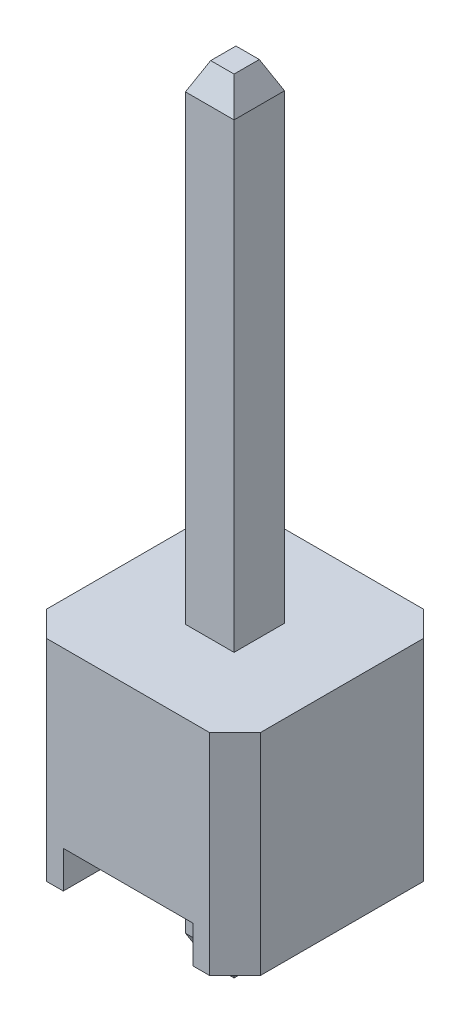
ISO-10303-21;
HEADER;
FILE_DESCRIPTION(('STEP AP214'),'2;1');
FILE_NAME('part.step','',(''),(''),'','','');
FILE_SCHEMA(('AUTOMOTIVE_DESIGN { 1 0 10303 214 1 1 1 1 }'));
ENDSEC;
DATA;
#1=APPLICATION_CONTEXT('core data for automotive mechanical design processes');
#2=APPLICATION_PROTOCOL_DEFINITION('international standard','automotive_design',2000,#1);
#3=PRODUCT_CONTEXT('',#1,'mechanical');
#4=PRODUCT('Part','Part','',(#3));
#5=PRODUCT_RELATED_PRODUCT_CATEGORY('part','',(#4));
#6=PRODUCT_DEFINITION_FORMATION('','',#4);
#7=PRODUCT_DEFINITION_CONTEXT('part definition',#1,'design');
#8=PRODUCT_DEFINITION('design','',#6,#7);
#9=PRODUCT_DEFINITION_SHAPE('','',#8);
#10=(LENGTH_UNIT() NAMED_UNIT(*) SI_UNIT(.MILLI.,.METRE.));
#11=(NAMED_UNIT(*) PLANE_ANGLE_UNIT() SI_UNIT($,.RADIAN.));
#12=(NAMED_UNIT(*) SI_UNIT($,.STERADIAN.) SOLID_ANGLE_UNIT());
#13=UNCERTAINTY_MEASURE_WITH_UNIT(LENGTH_MEASURE(1.E-05),#10,'distance_accuracy_value','');
#14=(GEOMETRIC_REPRESENTATION_CONTEXT(3) GLOBAL_UNCERTAINTY_ASSIGNED_CONTEXT((#13)) GLOBAL_UNIT_ASSIGNED_CONTEXT((#10,
#11,#12)) REPRESENTATION_CONTEXT('',''));
#15=CARTESIAN_POINT('',(0.,0.,0.));
#16=DIRECTION('',(0.,0.,1.));
#17=DIRECTION('',(1.,0.,0.));
#18=AXIS2_PLACEMENT_3D('',#15,#16,#17);
#19=CARTESIAN_POINT('',(-19.1812561045914,-5.69124998633488,-4.12837288882801));
#20=DIRECTION('',(0.,-1.,0.));
#21=DIRECTION('',(0.,0.,-1.));
#22=AXIS2_PLACEMENT_3D('',#19,#20,#21);
#23=PLANE('',#22);
#24=DIRECTION('',(0.,0.,1.));
#25=VECTOR('',#24,1.);
#26=CARTESIAN_POINT('',(-19.0312561045914,-5.69124998633488,-3.52837288882801));
#27=LINE('',#26,#25);
#28=CARTESIAN_POINT('',(-19.0312561045914,-5.69124998633488,-3.67837288882801));
#29=VERTEX_POINT('',#28);
#30=CARTESIAN_POINT('',(-19.0312561045914,-5.69124998633488,-3.97837288882801));
#31=VERTEX_POINT('',#30);
#32=EDGE_CURVE('E194',#29,#31,#27,.F.);
#33=ORIENTED_EDGE('',*,*,#32,.T.);
#34=DIRECTION('',(1.,0.,0.));
#35=VECTOR('',#34,1.);
#36=CARTESIAN_POINT('',(-19.1812561045914,-5.69124998633488,-3.97837288882801));
#37=LINE('',#36,#35);
#38=CARTESIAN_POINT('',(-18.7537499744834,-5.69124998633488,-3.97837288882801));
#39=VERTEX_POINT('',#38);
#40=EDGE_CURVE('E179',#31,#39,#37,.T.);
#41=ORIENTED_EDGE('',*,*,#40,.T.);
#42=DIRECTION('',(0.,0.,1.));
#43=VECTOR('',#42,1.);
#44=CARTESIAN_POINT('',(-18.7537499744834,-5.69124998633488,-4.12837288882801));
#45=LINE('',#44,#43);
#46=CARTESIAN_POINT('',(-18.7537499744834,-5.69124998633488,-3.67837288882801));
#47=VERTEX_POINT('',#46);
#48=EDGE_CURVE('E20',#39,#47,#45,.T.);
#49=ORIENTED_EDGE('',*,*,#48,.T.);
#50=DIRECTION('',(1.,0.,0.));
#51=VECTOR('',#50,1.);
#52=CARTESIAN_POINT('',(-18.6037499744834,-5.69124998633488,-3.67837288882801));
#53=LINE('',#52,#51);
#54=EDGE_CURVE('E174',#47,#29,#53,.F.);
#55=ORIENTED_EDGE('',*,*,#54,.T.);
#56=EDGE_LOOP('',(#33,#41,#49,#55));
#57=FACE_BOUND('',#56,.T.);
#58=ADVANCED_FACE('F17',(#57),#23,.T.);
#59=CARTESIAN_POINT('',(-18.6037499744834,-5.36957394825845,-4.12837288882801));
#60=DIRECTION('',(-0.90630778703665,0.4226182617407,0.));
#61=DIRECTION('',(-0.4226182617407,-0.90630778703665,0.));
#62=AXIS2_PLACEMENT_3D('',#59,#60,#61);
#63=PLANE('',#62);
#64=DIRECTION('',(0.,0.,-1.));
#65=VECTOR('',#64,1.);
#66=CARTESIAN_POINT('',(-18.6037499744834,-5.36957394825845,-4.12837288882801));
#67=LINE('',#66,#65);
#68=CARTESIAN_POINT('',(-18.6037499744834,-5.36957394825845,-3.52837288882801));
#69=VERTEX_POINT('',#68);
#70=CARTESIAN_POINT('',(-18.6037499744834,-5.36957394825845,-4.12837288882801));
#71=VERTEX_POINT('',#70);
#72=EDGE_CURVE('E186',#69,#71,#67,.T.);
#73=ORIENTED_EDGE('',*,*,#72,.F.);
#74=DIRECTION('',(-0.389281620635035,-0.834817129478983,-0.389281620635024));
#75=VECTOR('',#74,1.);
#76=CARTESIAN_POINT('',(-18.6037499744834,-5.36957394825845,-3.52837288882801));
#77=LINE('',#76,#75);
#78=EDGE_CURVE('E182',#69,#47,#77,.T.);
#79=ORIENTED_EDGE('',*,*,#78,.T.);
#80=ORIENTED_EDGE('',*,*,#48,.F.);
#81=DIRECTION('',(0.389281620635034,0.834817129478983,-0.389281620635025));
#82=VECTOR('',#81,1.);
#83=CARTESIAN_POINT('',(-18.7537499744834,-5.69124998633488,-3.97837288882801));
#84=LINE('',#83,#82);
#85=EDGE_CURVE('E202',#39,#71,#84,.T.);
#86=ORIENTED_EDGE('',*,*,#85,.T.);
#87=EDGE_LOOP('',(#73,#79,#80,#86));
#88=FACE_BOUND('',#87,.T.);
#89=ADVANCED_FACE('F184',(#88),#63,.F.);
#90=CARTESIAN_POINT('',(-18.6037499744834,-5.36957394825845,-3.52837288882801));
#91=DIRECTION('',(0.,0.422618261740701,-0.906307787036649));
#92=DIRECTION('',(0.,0.906307787036649,0.422618261740701));
#93=AXIS2_PLACEMENT_3D('',#90,#91,#92);
#94=PLANE('',#93);
#95=ORIENTED_EDGE('',*,*,#54,.F.);
#96=ORIENTED_EDGE('',*,*,#78,.F.);
#97=DIRECTION('',(1.,0.,0.));
#98=VECTOR('',#97,1.);
#99=CARTESIAN_POINT('',(-18.6037499744834,-5.36957394825845,-3.52837288882801));
#100=LINE('',#99,#98);
#101=CARTESIAN_POINT('',(-19.1812561045914,-5.36957394825845,-3.52837288882801));
#102=VERTEX_POINT('',#101);
#103=EDGE_CURVE('E205',#102,#69,#100,.T.);
#104=ORIENTED_EDGE('',*,*,#103,.F.);
#105=DIRECTION('',(0.389281620635027,-0.834817129478987,-0.389281620635025));
#106=VECTOR('',#105,1.);
#107=CARTESIAN_POINT('',(-19.1812561045914,-5.36957394825845,-3.52837288882801));
#108=LINE('',#107,#106);
#109=EDGE_CURVE('E191',#102,#29,#108,.T.);
#110=ORIENTED_EDGE('',*,*,#109,.T.);
#111=EDGE_LOOP('',(#95,#96,#104,#110));
#112=FACE_BOUND('',#111,.T.);
#113=ADVANCED_FACE('F189',(#112),#94,.F.);
#114=CARTESIAN_POINT('',(-19.1812561045914,-5.36957394825845,-3.52837288882801));
#115=DIRECTION('',(0.906307787036649,0.422618261740701,0.));
#116=DIRECTION('',(-0.422618261740701,0.906307787036649,0.));
#117=AXIS2_PLACEMENT_3D('',#114,#115,#116);
#118=PLANE('',#117);
#119=ORIENTED_EDGE('',*,*,#32,.F.);
#120=ORIENTED_EDGE('',*,*,#109,.F.);
#121=DIRECTION('',(0.,0.,1.));
#122=VECTOR('',#121,1.);
#123=CARTESIAN_POINT('',(-19.1812561045914,-5.36957394825845,-3.52837288882801));
#124=LINE('',#123,#122);
#125=CARTESIAN_POINT('',(-19.1812561045914,-5.36957394825845,-4.12837288882801));
#126=VERTEX_POINT('',#125);
#127=EDGE_CURVE('E211',#126,#102,#124,.T.);
#128=ORIENTED_EDGE('',*,*,#127,.F.);
#129=DIRECTION('',(0.389281620635027,-0.834817129478986,0.389281620635027));
#130=VECTOR('',#129,1.);
#131=CARTESIAN_POINT('',(-19.1812561045914,-5.36957394825845,-4.12837288882801));
#132=LINE('',#131,#130);
#133=EDGE_CURVE('E198',#126,#31,#132,.T.);
#134=ORIENTED_EDGE('',*,*,#133,.T.);
#135=EDGE_LOOP('',(#119,#120,#128,#134));
#136=FACE_BOUND('',#135,.T.);
#137=ADVANCED_FACE('F518',(#136),#118,.F.);
#138=CARTESIAN_POINT('',(-19.1812561045914,-5.36957394825845,-4.12837288882801));
#139=DIRECTION('',(0.,0.422618261740701,0.906307787036649));
#140=DIRECTION('',(0.,-0.906307787036649,0.422618261740701));
#141=AXIS2_PLACEMENT_3D('',#138,#139,#140);
#142=PLANE('',#141);
#143=ORIENTED_EDGE('',*,*,#40,.F.);
#144=ORIENTED_EDGE('',*,*,#133,.F.);
#145=DIRECTION('',(-1.,0.,0.));
#146=VECTOR('',#145,1.);
#147=CARTESIAN_POINT('',(-19.1812561045914,-5.36957394825845,-4.12837288882801));
#148=LINE('',#147,#146);
#149=EDGE_CURVE('E220',#71,#126,#148,.T.);
#150=ORIENTED_EDGE('',*,*,#149,.F.);
#151=ORIENTED_EDGE('',*,*,#85,.F.);
#152=EDGE_LOOP('',(#143,#144,#150,#151));
#153=FACE_BOUND('',#152,.T.);
#154=ADVANCED_FACE('F514',(#153),#142,.F.);
#155=CARTESIAN_POINT('',(-18.6037499744834,-5.69124998633488,-4.12837288882801));
#156=DIRECTION('',(1.,0.,0.));
#157=DIRECTION('',(0.,0.,-1.));
#158=AXIS2_PLACEMENT_3D('',#155,#156,#157);
#159=PLANE('',#158);
#160=DIRECTION('',(0.,1.,0.));
#161=VECTOR('',#160,1.);
#162=CARTESIAN_POINT('',(-18.6037499744834,-5.69124998633488,-4.12837288882801));
#163=LINE('',#162,#161);
#164=CARTESIAN_POINT('',(-18.6037499744834,-4.25124998633488,-4.12837288882801));
#165=VERTEX_POINT('',#164);
#166=EDGE_CURVE('E217',#165,#71,#163,.F.);
#167=ORIENTED_EDGE('',*,*,#166,.F.);
#168=DIRECTION('',(0.,0.,1.));
#169=VECTOR('',#168,1.);
#170=CARTESIAN_POINT('',(-18.6037499744834,-4.25124998633488,-2.55837288882801));
#171=LINE('',#170,#169);
#172=CARTESIAN_POINT('',(-18.6037499744834,-4.25124998633488,-3.52837288882801));
#173=VERTEX_POINT('',#172);
#174=EDGE_CURVE('E230',#165,#173,#171,.T.);
#175=ORIENTED_EDGE('',*,*,#174,.T.);
#176=DIRECTION('',(0.,1.,0.));
#177=VECTOR('',#176,1.);
#178=CARTESIAN_POINT('',(-18.6037499744834,-5.69124998633488,-3.52837288882801));
#179=LINE('',#178,#177);
#180=EDGE_CURVE('E208',#69,#173,#179,.T.);
#181=ORIENTED_EDGE('',*,*,#180,.F.);
#182=ORIENTED_EDGE('',*,*,#72,.T.);
#183=EDGE_LOOP('',(#167,#175,#181,#182));
#184=FACE_BOUND('',#183,.T.);
#185=ADVANCED_FACE('F510',(#184),#159,.T.);
#186=CARTESIAN_POINT('',(-18.6037499744834,-5.69124998633488,-3.52837288882801));
#187=DIRECTION('',(0.,0.,1.));
#188=DIRECTION('',(1.,0.,0.));
#189=AXIS2_PLACEMENT_3D('',#186,#187,#188);
#190=PLANE('',#189);
#191=ORIENTED_EDGE('',*,*,#180,.T.);
#192=DIRECTION('',(1.,0.,0.));
#193=VECTOR('',#192,1.);
#194=CARTESIAN_POINT('',(-18.1225030395374,-4.25124998633488,-3.52837288882801));
#195=LINE('',#194,#193);
#196=CARTESIAN_POINT('',(-19.1812561045914,-4.25124998633488,-3.52837288882801));
#197=VERTEX_POINT('',#196);
#198=EDGE_CURVE('E232',#173,#197,#195,.F.);
#199=ORIENTED_EDGE('',*,*,#198,.T.);
#200=DIRECTION('',(0.,1.,0.));
#201=VECTOR('',#200,1.);
#202=CARTESIAN_POINT('',(-19.1812561045914,-5.69124998633488,-3.52837288882801));
#203=LINE('',#202,#201);
#204=EDGE_CURVE('E214',#102,#197,#203,.T.);
#205=ORIENTED_EDGE('',*,*,#204,.F.);
#206=ORIENTED_EDGE('',*,*,#103,.T.);
#207=EDGE_LOOP('',(#191,#199,#205,#206));
#208=FACE_BOUND('',#207,.T.);
#209=ADVANCED_FACE('F506',(#208),#190,.T.);
#210=CARTESIAN_POINT('',(-19.1812561045914,-5.69124998633488,-3.52837288882801));
#211=DIRECTION('',(-1.,0.,0.));
#212=DIRECTION('',(0.,0.,1.));
#213=AXIS2_PLACEMENT_3D('',#210,#211,#212);
#214=PLANE('',#213);
#215=ORIENTED_EDGE('',*,*,#204,.T.);
#216=DIRECTION('',(0.,0.,1.));
#217=VECTOR('',#216,1.);
#218=CARTESIAN_POINT('',(-19.1812561045914,-4.25124998633488,-2.55837288882801));
#219=LINE('',#218,#217);
#220=CARTESIAN_POINT('',(-19.1812561045914,-4.25124998633488,-4.12837288882801));
#221=VERTEX_POINT('',#220);
#222=EDGE_CURVE('E234',#197,#221,#219,.F.);
#223=ORIENTED_EDGE('',*,*,#222,.T.);
#224=DIRECTION('',(0.,1.,0.));
#225=VECTOR('',#224,1.);
#226=CARTESIAN_POINT('',(-19.1812561045914,-5.69124998633488,-4.12837288882801));
#227=LINE('',#226,#225);
#228=EDGE_CURVE('E223',#126,#221,#227,.T.);
#229=ORIENTED_EDGE('',*,*,#228,.F.);
#230=ORIENTED_EDGE('',*,*,#127,.T.);
#231=EDGE_LOOP('',(#215,#223,#229,#230));
#232=FACE_BOUND('',#231,.T.);
#233=ADVANCED_FACE('F502',(#232),#214,.T.);
#234=CARTESIAN_POINT('',(-19.1812561045914,-5.69124998633488,-4.12837288882801));
#235=DIRECTION('',(0.,0.,-1.));
#236=DIRECTION('',(-1.,0.,0.));
#237=AXIS2_PLACEMENT_3D('',#234,#235,#236);
#238=PLANE('',#237);
#239=ORIENTED_EDGE('',*,*,#228,.T.);
#240=DIRECTION('',(1.,0.,0.));
#241=VECTOR('',#240,1.);
#242=CARTESIAN_POINT('',(-18.1225030395374,-4.25124998633488,-4.12837288882801));
#243=LINE('',#242,#241);
#244=EDGE_CURVE('E236',#221,#165,#243,.T.);
#245=ORIENTED_EDGE('',*,*,#244,.T.);
#246=ORIENTED_EDGE('',*,*,#166,.T.);
#247=ORIENTED_EDGE('',*,*,#149,.T.);
#248=EDGE_LOOP('',(#239,#245,#246,#247));
#249=FACE_BOUND('',#248,.T.);
#250=ADVANCED_FACE('F498',(#249),#238,.T.);
#251=CARTESIAN_POINT('',(-18.1225030395374,-4.25124998633488,-2.55837288882801));
#252=DIRECTION('',(0.,1.,0.));
#253=DIRECTION('',(0.,0.,1.));
#254=AXIS2_PLACEMENT_3D('',#251,#252,#253);
#255=PLANE('',#254);
#256=ORIENTED_EDGE('',*,*,#222,.F.);
#257=ORIENTED_EDGE('',*,*,#198,.F.);
#258=ORIENTED_EDGE('',*,*,#174,.F.);
#259=ORIENTED_EDGE('',*,*,#244,.F.);
#260=EDGE_LOOP('',(#256,#257,#258,#259));
#261=FACE_BOUND('',#260,.T.);
#262=DIRECTION('',(0.,0.,1.));
#263=VECTOR('',#262,1.);
#264=CARTESIAN_POINT('',(-19.6625030395374,-4.25124998633488,-2.55837288882801));
#265=LINE('',#264,#263);
#266=CARTESIAN_POINT('',(-19.6625030395374,-4.25124998633488,-2.55837288882801));
#267=VERTEX_POINT('',#266);
#268=CARTESIAN_POINT('',(-19.6625030395374,-4.25124998633488,-5.09837288882801));
#269=VERTEX_POINT('',#268);
#270=EDGE_CURVE('E241',#267,#269,#265,.F.);
#271=ORIENTED_EDGE('',*,*,#270,.T.);
#272=DIRECTION('',(1.,0.,0.));
#273=VECTOR('',#272,1.);
#274=CARTESIAN_POINT('',(-18.1225030395374,-4.25124998633488,-5.09837288882801));
#275=LINE('',#274,#273);
#276=CARTESIAN_POINT('',(-18.1225030395374,-4.25124998633488,-5.09837288882801));
#277=VERTEX_POINT('',#276);
#278=EDGE_CURVE('E226',#277,#269,#275,.F.);
#279=ORIENTED_EDGE('',*,*,#278,.F.);
#280=DIRECTION('',(0.,0.,-1.));
#281=VECTOR('',#280,1.);
#282=CARTESIAN_POINT('',(-18.1225030395374,-4.25124998633488,-2.55837288882801));
#283=LINE('',#282,#281);
#284=CARTESIAN_POINT('',(-18.1225030395374,-4.25124998633488,-2.55837288882801));
#285=VERTEX_POINT('',#284);
#286=EDGE_CURVE('E248',#277,#285,#283,.F.);
#287=ORIENTED_EDGE('',*,*,#286,.T.);
#288=DIRECTION('',(1.,0.,0.));
#289=VECTOR('',#288,1.);
#290=CARTESIAN_POINT('',(-18.1225030395374,-4.25124998633488,-2.55837288882801));
#291=LINE('',#290,#289);
#292=EDGE_CURVE('E228',#267,#285,#291,.T.);
#293=ORIENTED_EDGE('',*,*,#292,.F.);
#294=EDGE_LOOP('',(#271,#279,#287,#293));
#295=FACE_BOUND('',#294,.T.);
#296=ADVANCED_FACE('F495',(#261,#295),#255,.F.);
#297=CARTESIAN_POINT('',(-19.1812561045914,3.60875001366512,-3.97837288882801));
#298=DIRECTION('',(0.,0.422618261740697,-0.906307787036651));
#299=DIRECTION('',(0.,0.906307787036651,0.422618261740697));
#300=AXIS2_PLACEMENT_3D('',#297,#298,#299);
#301=PLANE('',#300);
#302=DIRECTION('',(-0.389281620635024,-0.834817129478989,-0.389281620635024));
#303=VECTOR('',#302,1.);
#304=CARTESIAN_POINT('',(-19.0312561045914,3.60875001366512,-3.97837288882801));
#305=LINE('',#304,#303);
#306=CARTESIAN_POINT('',(-19.0312561045914,3.60875001366512,-3.97837288882801));
#307=VERTEX_POINT('',#306);
#308=CARTESIAN_POINT('',(-19.1812561045914,3.28707397558869,-4.12837288882801));
#309=VERTEX_POINT('',#308);
#310=EDGE_CURVE('E263',#307,#309,#305,.T.);
#311=ORIENTED_EDGE('',*,*,#310,.F.);
#312=DIRECTION('',(1.,0.,0.));
#313=VECTOR('',#312,1.);
#314=CARTESIAN_POINT('',(-19.1812561045914,3.60875001366512,-3.97837288882801));
#315=LINE('',#314,#313);
#316=CARTESIAN_POINT('',(-18.7537499744834,3.60875001366512,-3.97837288882801));
#317=VERTEX_POINT('',#316);
#318=EDGE_CURVE('E256',#307,#317,#315,.T.);
#319=ORIENTED_EDGE('',*,*,#318,.T.);
#320=DIRECTION('',(-0.389281620635023,0.83481712947899,0.389281620635023));
#321=VECTOR('',#320,1.);
#322=CARTESIAN_POINT('',(-18.6037499744834,3.28707397558868,-4.12837288882801));
#323=LINE('',#322,#321);
#324=CARTESIAN_POINT('',(-18.6037499744834,3.28707397558869,-4.12837288882801));
#325=VERTEX_POINT('',#324);
#326=EDGE_CURVE('E253',#325,#317,#323,.T.);
#327=ORIENTED_EDGE('',*,*,#326,.F.);
#328=DIRECTION('',(-1.,0.,0.));
#329=VECTOR('',#328,1.);
#330=CARTESIAN_POINT('',(-19.1812561045914,3.28707397558869,-4.12837288882801));
#331=LINE('',#330,#329);
#332=EDGE_CURVE('E266',#309,#325,#331,.F.);
#333=ORIENTED_EDGE('',*,*,#332,.F.);
#334=EDGE_LOOP('',(#311,#319,#327,#333));
#335=FACE_BOUND('',#334,.T.);
#336=ADVANCED_FACE('F472',(#335),#301,.T.);
#337=CARTESIAN_POINT('',(-19.6625030395374,-4.25124998633488,-2.55837288882801));
#338=DIRECTION('',(-1.,0.,0.));
#339=DIRECTION('',(0.,0.,1.));
#340=AXIS2_PLACEMENT_3D('',#337,#338,#339);
#341=PLANE('',#340);
#342=DIRECTION('',(0.,1.,0.));
#343=VECTOR('',#342,1.);
#344=CARTESIAN_POINT('',(-19.6625030395374,-4.25124998633488,-5.09837288882801));
#345=LINE('',#344,#343);
#346=CARTESIAN_POINT('',(-19.6625030395374,-4.69124998633488,-5.09837288882801));
#347=VERTEX_POINT('',#346);
#348=EDGE_CURVE('E244',#269,#347,#345,.F.);
#349=ORIENTED_EDGE('',*,*,#348,.F.);
#350=ORIENTED_EDGE('',*,*,#270,.F.);
#351=DIRECTION('',(0.,1.,0.));
#352=VECTOR('',#351,1.);
#353=CARTESIAN_POINT('',(-19.6625030395374,-4.25124998633488,-2.55837288882801));
#354=LINE('',#353,#352);
#355=CARTESIAN_POINT('',(-19.6625030395374,-4.69124998633488,-2.55837288882801));
#356=VERTEX_POINT('',#355);
#357=EDGE_CURVE('E239',#356,#267,#354,.T.);
#358=ORIENTED_EDGE('',*,*,#357,.F.);
#359=DIRECTION('',(0.,0.,1.));
#360=VECTOR('',#359,1.);
#361=CARTESIAN_POINT('',(-19.6625030395374,-4.69124998633488,-3.82837288882801));
#362=LINE('',#361,#360);
#363=EDGE_CURVE('E273',#356,#347,#362,.F.);
#364=ORIENTED_EDGE('',*,*,#363,.T.);
#365=EDGE_LOOP('',(#349,#350,#358,#364));
#366=FACE_BOUND('',#365,.T.);
#367=ADVANCED_FACE('F488',(#366),#341,.F.);
#368=CARTESIAN_POINT('',(-18.1225030395374,-4.25124998633488,-2.55837288882801));
#369=DIRECTION('',(1.,0.,0.));
#370=DIRECTION('',(0.,0.,-1.));
#371=AXIS2_PLACEMENT_3D('',#368,#369,#370);
#372=PLANE('',#371);
#373=DIRECTION('',(0.,1.,0.));
#374=VECTOR('',#373,1.);
#375=CARTESIAN_POINT('',(-18.1225030395374,-4.25124998633488,-2.55837288882801));
#376=LINE('',#375,#374);
#377=CARTESIAN_POINT('',(-18.1225030395374,-4.69124998633488,-2.55837288882801));
#378=VERTEX_POINT('',#377);
#379=EDGE_CURVE('E251',#285,#378,#376,.F.);
#380=ORIENTED_EDGE('',*,*,#379,.F.);
#381=ORIENTED_EDGE('',*,*,#286,.F.);
#382=DIRECTION('',(0.,1.,0.));
#383=VECTOR('',#382,1.);
#384=CARTESIAN_POINT('',(-18.1225030395374,-4.25124998633488,-5.09837288882801));
#385=LINE('',#384,#383);
#386=CARTESIAN_POINT('',(-18.1225030395374,-4.69124998633488,-5.09837288882801));
#387=VERTEX_POINT('',#386);
#388=EDGE_CURVE('E246',#387,#277,#385,.T.);
#389=ORIENTED_EDGE('',*,*,#388,.F.);
#390=DIRECTION('',(0.,0.,1.));
#391=VECTOR('',#390,1.);
#392=CARTESIAN_POINT('',(-18.1225030395374,-4.69124998633488,-3.82837288882801));
#393=LINE('',#392,#391);
#394=EDGE_CURVE('E288',#387,#378,#393,.T.);
#395=ORIENTED_EDGE('',*,*,#394,.T.);
#396=EDGE_LOOP('',(#380,#381,#389,#395));
#397=FACE_BOUND('',#396,.T.);
#398=ADVANCED_FACE('F482',(#397),#372,.F.);
#399=CARTESIAN_POINT('',(-18.7537499744834,3.60875001366512,-4.12837288882801));
#400=DIRECTION('',(0.906307787036651,0.422618261740697,0.));
#401=DIRECTION('',(-0.422618261740697,0.906307787036651,0.));
#402=AXIS2_PLACEMENT_3D('',#399,#400,#401);
#403=PLANE('',#402);
#404=ORIENTED_EDGE('',*,*,#326,.T.);
#405=DIRECTION('',(0.,0.,-1.));
#406=VECTOR('',#405,1.);
#407=CARTESIAN_POINT('',(-18.7537499744834,3.60875001366512,-4.12837288882801));
#408=LINE('',#407,#406);
#409=CARTESIAN_POINT('',(-18.7537499744834,3.60875001366512,-3.67837288882801));
#410=VERTEX_POINT('',#409);
#411=EDGE_CURVE('E258',#317,#410,#408,.F.);
#412=ORIENTED_EDGE('',*,*,#411,.T.);
#413=DIRECTION('',(-0.389281620635032,0.834817129478986,-0.389281620635022));
#414=VECTOR('',#413,1.);
#415=CARTESIAN_POINT('',(-18.6037499744834,3.28707397558869,-3.52837288882801));
#416=LINE('',#415,#414);
#417=CARTESIAN_POINT('',(-18.6037499744834,3.28707397558869,-3.52837288882801));
#418=VERTEX_POINT('',#417);
#419=EDGE_CURVE('E310',#418,#410,#416,.T.);
#420=ORIENTED_EDGE('',*,*,#419,.F.);
#421=DIRECTION('',(0.,0.,-1.));
#422=VECTOR('',#421,1.);
#423=CARTESIAN_POINT('',(-18.6037499744834,3.28707397558869,-4.12837288882801));
#424=LINE('',#423,#422);
#425=EDGE_CURVE('E303',#325,#418,#424,.F.);
#426=ORIENTED_EDGE('',*,*,#425,.F.);
#427=EDGE_LOOP('',(#404,#412,#420,#426));
#428=FACE_BOUND('',#427,.T.);
#429=ADVANCED_FACE('F466',(#428),#403,.T.);
#430=CARTESIAN_POINT('',(-19.1812561045914,3.60875001366512,-4.12837288882801));
#431=DIRECTION('',(0.,-1.,0.));
#432=DIRECTION('',(0.,0.,-1.));
#433=AXIS2_PLACEMENT_3D('',#430,#431,#432);
#434=PLANE('',#433);
#435=ORIENTED_EDGE('',*,*,#318,.F.);
#436=DIRECTION('',(0.,0.,1.));
#437=VECTOR('',#436,1.);
#438=CARTESIAN_POINT('',(-19.0312561045914,3.60875001366512,-4.12837288882801));
#439=LINE('',#438,#437);
#440=CARTESIAN_POINT('',(-19.0312561045914,3.60875001366512,-3.67837288882801));
#441=VERTEX_POINT('',#440);
#442=EDGE_CURVE('E260',#441,#307,#439,.F.);
#443=ORIENTED_EDGE('',*,*,#442,.F.);
#444=DIRECTION('',(1.,0.,0.));
#445=VECTOR('',#444,1.);
#446=CARTESIAN_POINT('',(-19.1812561045914,3.60875001366512,-3.67837288882801));
#447=LINE('',#446,#445);
#448=EDGE_CURVE('E313',#410,#441,#447,.F.);
#449=ORIENTED_EDGE('',*,*,#448,.F.);
#450=ORIENTED_EDGE('',*,*,#411,.F.);
#451=EDGE_LOOP('',(#435,#443,#449,#450));
#452=FACE_BOUND('',#451,.T.);
#453=ADVANCED_FACE('F474',(#452),#434,.F.);
#454=CARTESIAN_POINT('',(-19.0312561045914,3.60875001366512,-4.12837288882801));
#455=DIRECTION('',(-0.906307787036651,0.422618261740697,0.));
#456=DIRECTION('',(-0.422618261740697,-0.906307787036651,0.));
#457=AXIS2_PLACEMENT_3D('',#454,#455,#456);
#458=PLANE('',#457);
#459=ORIENTED_EDGE('',*,*,#310,.T.);
#460=DIRECTION('',(0.,0.,1.));
#461=VECTOR('',#460,1.);
#462=CARTESIAN_POINT('',(-19.1812561045914,3.28707397558869,-3.52837288882801));
#463=LINE('',#462,#461);
#464=CARTESIAN_POINT('',(-19.1812561045914,3.28707397558869,-3.52837288882801));
#465=VERTEX_POINT('',#464);
#466=EDGE_CURVE('E316',#465,#309,#463,.F.);
#467=ORIENTED_EDGE('',*,*,#466,.F.);
#468=DIRECTION('',(-0.389281620635024,-0.834817129478989,0.389281620635023));
#469=VECTOR('',#468,1.);
#470=CARTESIAN_POINT('',(-19.0312561045914,3.60875001366512,-3.67837288882801));
#471=LINE('',#470,#469);
#472=EDGE_CURVE('E307',#441,#465,#471,.T.);
#473=ORIENTED_EDGE('',*,*,#472,.F.);
#474=ORIENTED_EDGE('',*,*,#442,.T.);
#475=EDGE_LOOP('',(#459,#467,#473,#474));
#476=FACE_BOUND('',#475,.T.);
#477=ADVANCED_FACE('F471',(#476),#458,.T.);
#478=CARTESIAN_POINT('',(-19.1812561045914,-5.69124998633488,-4.12837288882801));
#479=DIRECTION('',(0.,0.,-1.));
#480=DIRECTION('',(-1.,0.,0.));
#481=AXIS2_PLACEMENT_3D('',#478,#479,#480);
#482=PLANE('',#481);
#483=DIRECTION('',(0.,1.,0.));
#484=VECTOR('',#483,1.);
#485=CARTESIAN_POINT('',(-18.6037499744834,-5.69124998633488,-4.12837288882801));
#486=LINE('',#485,#484);
#487=CARTESIAN_POINT('',(-18.6037499744834,-2.19124998633488,-4.12837288882801));
#488=VERTEX_POINT('',#487);
#489=EDGE_CURVE('E300',#488,#325,#486,.T.);
#490=ORIENTED_EDGE('',*,*,#489,.F.);
#491=DIRECTION('',(-1.,0.,0.));
#492=VECTOR('',#491,1.);
#493=CARTESIAN_POINT('',(-19.1812561045914,-2.19124998633488,-4.12837288882801));
#494=LINE('',#493,#492);
#495=CARTESIAN_POINT('',(-19.1812561045914,-2.19124998633488,-4.12837288882801));
#496=VERTEX_POINT('',#495);
#497=EDGE_CURVE('E269',#488,#496,#494,.T.);
#498=ORIENTED_EDGE('',*,*,#497,.T.);
#499=DIRECTION('',(0.,1.,0.));
#500=VECTOR('',#499,1.);
#501=CARTESIAN_POINT('',(-19.1812561045914,-5.69124998633488,-4.12837288882801));
#502=LINE('',#501,#500);
#503=EDGE_CURVE('E319',#309,#496,#502,.F.);
#504=ORIENTED_EDGE('',*,*,#503,.F.);
#505=ORIENTED_EDGE('',*,*,#332,.T.);
#506=EDGE_LOOP('',(#490,#498,#504,#505));
#507=FACE_BOUND('',#506,.T.);
#508=ADVANCED_FACE('F462',(#507),#482,.T.);
#509=CARTESIAN_POINT('',(-21.1325030395374,-4.69124998633488,-3.82837288882801));
#510=DIRECTION('',(0.,1.,0.));
#511=DIRECTION('',(0.,0.,1.));
#512=AXIS2_PLACEMENT_3D('',#509,#510,#511);
#513=PLANE('',#512);
#514=ORIENTED_EDGE('',*,*,#363,.F.);
#515=DIRECTION('',(1.,0.,0.));
#516=VECTOR('',#515,1.);
#517=CARTESIAN_POINT('',(-21.1325030395374,-4.69124998633488,-2.55837288882801));
#518=LINE('',#517,#516);
#519=CARTESIAN_POINT('',(-19.8625030395374,-4.69124998633488,-2.55837288882801));
#520=VERTEX_POINT('',#519);
#521=EDGE_CURVE('E271',#520,#356,#518,.T.);
#522=ORIENTED_EDGE('',*,*,#521,.F.);
#523=DIRECTION('',(-0.707106781186549,0.,-0.707106781186546));
#524=VECTOR('',#523,1.);
#525=CARTESIAN_POINT('',(-20.1625030395374,-4.69124998633488,-2.85837288882801));
#526=LINE('',#525,#524);
#527=CARTESIAN_POINT('',(-20.1625030395374,-4.69124998633488,-2.85837288882801));
#528=VERTEX_POINT('',#527);
#529=EDGE_CURVE('E280',#520,#528,#526,.T.);
#530=ORIENTED_EDGE('',*,*,#529,.T.);
#531=DIRECTION('',(0.,0.,-1.));
#532=VECTOR('',#531,1.);
#533=CARTESIAN_POINT('',(-20.1625030395374,-4.69124998633488,-4.79837288882801));
#534=LINE('',#533,#532);
#535=CARTESIAN_POINT('',(-20.1625030395374,-4.69124998633488,-4.79837288882801));
#536=VERTEX_POINT('',#535);
#537=EDGE_CURVE('E330',#528,#536,#534,.T.);
#538=ORIENTED_EDGE('',*,*,#537,.T.);
#539=DIRECTION('',(0.707106781186549,0.,-0.707106781186546));
#540=VECTOR('',#539,1.);
#541=CARTESIAN_POINT('',(-19.8625030395374,-4.69124998633488,-5.09837288882801));
#542=LINE('',#541,#540);
#543=CARTESIAN_POINT('',(-19.8625030395374,-4.69124998633488,-5.09837288882801));
#544=VERTEX_POINT('',#543);
#545=EDGE_CURVE('E297',#536,#544,#542,.T.);
#546=ORIENTED_EDGE('',*,*,#545,.T.);
#547=DIRECTION('',(1.,0.,0.));
#548=VECTOR('',#547,1.);
#549=CARTESIAN_POINT('',(-21.1325030395374,-4.69124998633488,-5.09837288882801));
#550=LINE('',#549,#548);
#551=EDGE_CURVE('E276',#347,#544,#550,.F.);
#552=ORIENTED_EDGE('',*,*,#551,.F.);
#553=EDGE_LOOP('',(#514,#522,#530,#538,#546,#552));
#554=FACE_BOUND('',#553,.T.);
#555=ADVANCED_FACE('F630',(#554),#513,.F.);
#556=CARTESIAN_POINT('',(-20.1625030395374,-2.19124998633488,-2.85837288882801));
#557=DIRECTION('',(0.707106781186546,0.,-0.707106781186549));
#558=DIRECTION('',(-0.707106781186549,0.,-0.707106781186546));
#559=AXIS2_PLACEMENT_3D('',#556,#557,#558);
#560=PLANE('',#559);
#561=DIRECTION('',(0.,1.,0.));
#562=VECTOR('',#561,1.);
#563=CARTESIAN_POINT('',(-19.8625030395374,-2.19124998633488,-2.55837288882801));
#564=LINE('',#563,#562);
#565=CARTESIAN_POINT('',(-19.8625030395374,-2.19124998633488,-2.55837288882801));
#566=VERTEX_POINT('',#565);
#567=EDGE_CURVE('E333',#520,#566,#564,.T.);
#568=ORIENTED_EDGE('',*,*,#567,.T.);
#569=DIRECTION('',(-0.707106781186549,0.,-0.707106781186546));
#570=VECTOR('',#569,1.);
#571=CARTESIAN_POINT('',(-20.1625030395374,-2.19124998633488,-2.85837288882801));
#572=LINE('',#571,#570);
#573=CARTESIAN_POINT('',(-20.1625030395374,-2.19124998633488,-2.85837288882801));
#574=VERTEX_POINT('',#573);
#575=EDGE_CURVE('E278',#574,#566,#572,.F.);
#576=ORIENTED_EDGE('',*,*,#575,.F.);
#577=DIRECTION('',(0.,1.,0.));
#578=VECTOR('',#577,1.);
#579=CARTESIAN_POINT('',(-20.1625030395374,-2.19124998633488,-2.85837288882801));
#580=LINE('',#579,#578);
#581=EDGE_CURVE('E327',#574,#528,#580,.F.);
#582=ORIENTED_EDGE('',*,*,#581,.T.);
#583=ORIENTED_EDGE('',*,*,#529,.F.);
#584=EDGE_LOOP('',(#568,#576,#582,#583));
#585=FACE_BOUND('',#584,.T.);
#586=ADVANCED_FACE('F395',(#585),#560,.F.);
#587=CARTESIAN_POINT('',(-17.9225030395374,-2.19124998633488,-2.55837288882801));
#588=DIRECTION('',(-0.707106781186549,0.,-0.707106781186546));
#589=DIRECTION('',(-0.707106781186546,0.,0.707106781186549));
#590=AXIS2_PLACEMENT_3D('',#587,#588,#589);
#591=PLANE('',#590);
#592=DIRECTION('',(0.,1.,0.));
#593=VECTOR('',#592,1.);
#594=CARTESIAN_POINT('',(-17.6225030395374,-2.19124998633488,-2.85837288882801));
#595=LINE('',#594,#593);
#596=CARTESIAN_POINT('',(-17.6225030395374,-4.69124998633488,-2.85837288882801));
#597=VERTEX_POINT('',#596);
#598=CARTESIAN_POINT('',(-17.6225030395374,-2.19124998633488,-2.85837288882801));
#599=VERTEX_POINT('',#598);
#600=EDGE_CURVE('E341',#597,#599,#595,.T.);
#601=ORIENTED_EDGE('',*,*,#600,.T.);
#602=DIRECTION('',(-0.707106781186546,0.,0.707106781186549));
#603=VECTOR('',#602,1.);
#604=CARTESIAN_POINT('',(-17.9225030395374,-2.19124998633488,-2.55837288882801));
#605=LINE('',#604,#603);
#606=CARTESIAN_POINT('',(-17.9225030395374,-2.19124998633488,-2.55837288882801));
#607=VERTEX_POINT('',#606);
#608=EDGE_CURVE('E282',#607,#599,#605,.F.);
#609=ORIENTED_EDGE('',*,*,#608,.F.);
#610=DIRECTION('',(0.,1.,0.));
#611=VECTOR('',#610,1.);
#612=CARTESIAN_POINT('',(-17.9225030395374,-2.19124998633488,-2.55837288882801));
#613=LINE('',#612,#611);
#614=CARTESIAN_POINT('',(-17.9225030395374,-4.69124998633488,-2.55837288882801));
#615=VERTEX_POINT('',#614);
#616=EDGE_CURVE('E336',#607,#615,#613,.F.);
#617=ORIENTED_EDGE('',*,*,#616,.T.);
#618=DIRECTION('',(0.707106781186547,0.,-0.707106781186549));
#619=VECTOR('',#618,1.);
#620=CARTESIAN_POINT('',(-17.9225030395374,-4.69124998633488,-2.55837288882801));
#621=LINE('',#620,#619);
#622=EDGE_CURVE('E284',#615,#597,#621,.T.);
#623=ORIENTED_EDGE('',*,*,#622,.T.);
#624=EDGE_LOOP('',(#601,#609,#617,#623));
#625=FACE_BOUND('',#624,.T.);
#626=ADVANCED_FACE('F402',(#625),#591,.F.);
#627=CARTESIAN_POINT('',(-21.1325030395374,-4.69124998633488,-3.82837288882801));
#628=DIRECTION('',(0.,1.,0.));
#629=DIRECTION('',(0.,0.,1.));
#630=AXIS2_PLACEMENT_3D('',#627,#628,#629);
#631=PLANE('',#630);
#632=ORIENTED_EDGE('',*,*,#394,.F.);
#633=DIRECTION('',(1.,0.,0.));
#634=VECTOR('',#633,1.);
#635=CARTESIAN_POINT('',(-21.1325030395374,-4.69124998633488,-5.09837288882801));
#636=LINE('',#635,#634);
#637=CARTESIAN_POINT('',(-17.9225030395374,-4.69124998633488,-5.09837288882801));
#638=VERTEX_POINT('',#637);
#639=EDGE_CURVE('E286',#638,#387,#636,.F.);
#640=ORIENTED_EDGE('',*,*,#639,.F.);
#641=DIRECTION('',(0.707106781186547,0.,0.707106781186548));
#642=VECTOR('',#641,1.);
#643=CARTESIAN_POINT('',(-17.6225030395374,-4.69124998633488,-4.79837288882801));
#644=LINE('',#643,#642);
#645=CARTESIAN_POINT('',(-17.6225030395374,-4.69124998633488,-4.79837288882801));
#646=VERTEX_POINT('',#645);
#647=EDGE_CURVE('E293',#638,#646,#644,.T.);
#648=ORIENTED_EDGE('',*,*,#647,.T.);
#649=DIRECTION('',(0.,0.,1.));
#650=VECTOR('',#649,1.);
#651=CARTESIAN_POINT('',(-17.6225030395374,-4.69124998633488,-2.85837288882801));
#652=LINE('',#651,#650);
#653=EDGE_CURVE('E347',#646,#597,#652,.T.);
#654=ORIENTED_EDGE('',*,*,#653,.T.);
#655=ORIENTED_EDGE('',*,*,#622,.F.);
#656=DIRECTION('',(-1.,0.,0.));
#657=VECTOR('',#656,1.);
#658=CARTESIAN_POINT('',(-19.8625030395374,-4.69124998633488,-2.55837288882801));
#659=LINE('',#658,#657);
#660=EDGE_CURVE('E338',#615,#378,#659,.T.);
#661=ORIENTED_EDGE('',*,*,#660,.T.);
#662=EDGE_LOOP('',(#632,#640,#648,#654,#655,#661));
#663=FACE_BOUND('',#662,.T.);
#664=ADVANCED_FACE('F405',(#663),#631,.F.);
#665=CARTESIAN_POINT('',(-17.6225030395374,-2.19124998633488,-4.79837288882801));
#666=DIRECTION('',(-0.707106781186548,0.,0.707106781186547));
#667=DIRECTION('',(0.707106781186547,0.,0.707106781186548));
#668=AXIS2_PLACEMENT_3D('',#665,#666,#667);
#669=PLANE('',#668);
#670=DIRECTION('',(0.,1.,0.));
#671=VECTOR('',#670,1.);
#672=CARTESIAN_POINT('',(-17.9225030395374,-2.19124998633488,-5.09837288882801));
#673=LINE('',#672,#671);
#674=CARTESIAN_POINT('',(-17.9225030395374,-2.19124998633488,-5.09837288882801));
#675=VERTEX_POINT('',#674);
#676=EDGE_CURVE('E350',#638,#675,#673,.T.);
#677=ORIENTED_EDGE('',*,*,#676,.T.);
#678=DIRECTION('',(0.707106781186547,0.,0.707106781186548));
#679=VECTOR('',#678,1.);
#680=CARTESIAN_POINT('',(-17.6225030395374,-2.19124998633488,-4.79837288882801));
#681=LINE('',#680,#679);
#682=CARTESIAN_POINT('',(-17.6225030395374,-2.19124998633488,-4.79837288882801));
#683=VERTEX_POINT('',#682);
#684=EDGE_CURVE('E291',#683,#675,#681,.F.);
#685=ORIENTED_EDGE('',*,*,#684,.F.);
#686=DIRECTION('',(0.,1.,0.));
#687=VECTOR('',#686,1.);
#688=CARTESIAN_POINT('',(-17.6225030395374,-2.19124998633488,-4.79837288882801));
#689=LINE('',#688,#687);
#690=EDGE_CURVE('E344',#683,#646,#689,.F.);
#691=ORIENTED_EDGE('',*,*,#690,.T.);
#692=ORIENTED_EDGE('',*,*,#647,.F.);
#693=EDGE_LOOP('',(#677,#685,#691,#692));
#694=FACE_BOUND('',#693,.T.);
#695=ADVANCED_FACE('F414',(#694),#669,.F.);
#696=CARTESIAN_POINT('',(-19.8625030395374,-2.19124998633488,-5.09837288882801));
#697=DIRECTION('',(0.707106781186546,0.,0.707106781186549));
#698=DIRECTION('',(0.707106781186549,0.,-0.707106781186546));
#699=AXIS2_PLACEMENT_3D('',#696,#697,#698);
#700=PLANE('',#699);
#701=DIRECTION('',(0.,1.,0.));
#702=VECTOR('',#701,1.);
#703=CARTESIAN_POINT('',(-20.1625030395374,-2.19124998633488,-4.79837288882801));
#704=LINE('',#703,#702);
#705=CARTESIAN_POINT('',(-20.1625030395374,-2.19124998633488,-4.79837288882801));
#706=VERTEX_POINT('',#705);
#707=EDGE_CURVE('E324',#536,#706,#704,.T.);
#708=ORIENTED_EDGE('',*,*,#707,.T.);
#709=DIRECTION('',(0.707106781186549,0.,-0.707106781186546));
#710=VECTOR('',#709,1.);
#711=CARTESIAN_POINT('',(-19.8625030395374,-2.19124998633488,-5.09837288882801));
#712=LINE('',#711,#710);
#713=CARTESIAN_POINT('',(-19.8625030395374,-2.19124998633488,-5.09837288882801));
#714=VERTEX_POINT('',#713);
#715=EDGE_CURVE('E295',#714,#706,#712,.F.);
#716=ORIENTED_EDGE('',*,*,#715,.F.);
#717=DIRECTION('',(0.,1.,0.));
#718=VECTOR('',#717,1.);
#719=CARTESIAN_POINT('',(-19.8625030395374,-2.19124998633488,-5.09837288882801));
#720=LINE('',#719,#718);
#721=EDGE_CURVE('E353',#714,#544,#720,.F.);
#722=ORIENTED_EDGE('',*,*,#721,.T.);
#723=ORIENTED_EDGE('',*,*,#545,.F.);
#724=EDGE_LOOP('',(#708,#716,#722,#723));
#725=FACE_BOUND('',#724,.T.);
#726=ADVANCED_FACE('F384',(#725),#700,.F.);
#727=CARTESIAN_POINT('',(-18.6037499744834,-5.69124998633488,-4.12837288882801));
#728=DIRECTION('',(1.,0.,0.));
#729=DIRECTION('',(0.,0.,-1.));
#730=AXIS2_PLACEMENT_3D('',#727,#728,#729);
#731=PLANE('',#730);
#732=DIRECTION('',(0.,1.,0.));
#733=VECTOR('',#732,1.);
#734=CARTESIAN_POINT('',(-18.6037499744834,-5.69124998633488,-3.52837288882801));
#735=LINE('',#734,#733);
#736=CARTESIAN_POINT('',(-18.6037499744834,-2.19124998633488,-3.52837288882801));
#737=VERTEX_POINT('',#736);
#738=EDGE_CURVE('E356',#737,#418,#735,.T.);
#739=ORIENTED_EDGE('',*,*,#738,.F.);
#740=DIRECTION('',(0.,0.,-1.));
#741=VECTOR('',#740,1.);
#742=CARTESIAN_POINT('',(-18.6037499744834,-2.19124998633488,-4.12837288882801));
#743=LINE('',#742,#741);
#744=EDGE_CURVE('E34',#737,#488,#743,.T.);
#745=ORIENTED_EDGE('',*,*,#744,.T.);
#746=ORIENTED_EDGE('',*,*,#489,.T.);
#747=ORIENTED_EDGE('',*,*,#425,.T.);
#748=EDGE_LOOP('',(#739,#745,#746,#747));
#749=FACE_BOUND('',#748,.T.);
#750=ADVANCED_FACE('F422',(#749),#731,.T.);
#751=CARTESIAN_POINT('',(-19.1812561045914,3.60875001366512,-3.67837288882801));
#752=DIRECTION('',(0.,0.422618261740697,0.906307787036651));
#753=DIRECTION('',(0.,-0.906307787036651,0.422618261740697));
#754=AXIS2_PLACEMENT_3D('',#751,#752,#753);
#755=PLANE('',#754);
#756=ORIENTED_EDGE('',*,*,#419,.T.);
#757=ORIENTED_EDGE('',*,*,#448,.T.);
#758=ORIENTED_EDGE('',*,*,#472,.T.);
#759=DIRECTION('',(1.,0.,0.));
#760=VECTOR('',#759,1.);
#761=CARTESIAN_POINT('',(-18.6037499744834,3.28707397558869,-3.52837288882801));
#762=LINE('',#761,#760);
#763=EDGE_CURVE('E359',#418,#465,#762,.F.);
#764=ORIENTED_EDGE('',*,*,#763,.F.);
#765=EDGE_LOOP('',(#756,#757,#758,#764));
#766=FACE_BOUND('',#765,.T.);
#767=ADVANCED_FACE('F445',(#766),#755,.T.);
#768=CARTESIAN_POINT('',(-19.1812561045914,-5.69124998633488,-3.52837288882801));
#769=DIRECTION('',(-1.,0.,0.));
#770=DIRECTION('',(0.,0.,1.));
#771=AXIS2_PLACEMENT_3D('',#768,#769,#770);
#772=PLANE('',#771);
#773=ORIENTED_EDGE('',*,*,#503,.T.);
#774=DIRECTION('',(0.,0.,1.));
#775=VECTOR('',#774,1.);
#776=CARTESIAN_POINT('',(-19.1812561045914,-2.19124998633488,-3.52837288882801));
#777=LINE('',#776,#775);
#778=CARTESIAN_POINT('',(-19.1812561045914,-2.19124998633488,-3.52837288882801));
#779=VERTEX_POINT('',#778);
#780=EDGE_CURVE('E322',#496,#779,#777,.T.);
#781=ORIENTED_EDGE('',*,*,#780,.T.);
#782=DIRECTION('',(0.,1.,0.));
#783=VECTOR('',#782,1.);
#784=CARTESIAN_POINT('',(-19.1812561045914,-5.69124998633488,-3.52837288882801));
#785=LINE('',#784,#783);
#786=EDGE_CURVE('E362',#465,#779,#785,.F.);
#787=ORIENTED_EDGE('',*,*,#786,.F.);
#788=ORIENTED_EDGE('',*,*,#466,.T.);
#789=EDGE_LOOP('',(#773,#781,#787,#788));
#790=FACE_BOUND('',#789,.T.);
#791=ADVANCED_FACE('F442',(#790),#772,.T.);
#792=CARTESIAN_POINT('',(-20.1625030395374,-2.19124998633488,-4.79837288882801));
#793=DIRECTION('',(1.,0.,0.));
#794=DIRECTION('',(0.,0.,-1.));
#795=AXIS2_PLACEMENT_3D('',#792,#793,#794);
#796=PLANE('',#795);
#797=ORIENTED_EDGE('',*,*,#581,.F.);
#798=DIRECTION('',(0.,0.,1.));
#799=VECTOR('',#798,1.);
#800=CARTESIAN_POINT('',(-20.1625030395374,-2.19124998633488,-3.82837288882801));
#801=LINE('',#800,#799);
#802=EDGE_CURVE('E365',#706,#574,#801,.T.);
#803=ORIENTED_EDGE('',*,*,#802,.F.);
#804=ORIENTED_EDGE('',*,*,#707,.F.);
#805=ORIENTED_EDGE('',*,*,#537,.F.);
#806=EDGE_LOOP('',(#797,#803,#804,#805));
#807=FACE_BOUND('',#806,.T.);
#808=ADVANCED_FACE('F390',(#807),#796,.F.);
#809=CARTESIAN_POINT('',(-19.8625030395374,-2.19124998633488,-2.55837288882801));
#810=DIRECTION('',(0.,0.,-1.));
#811=DIRECTION('',(-1.,0.,0.));
#812=AXIS2_PLACEMENT_3D('',#809,#810,#811);
#813=PLANE('',#812);
#814=ORIENTED_EDGE('',*,*,#379,.T.);
#815=ORIENTED_EDGE('',*,*,#660,.F.);
#816=ORIENTED_EDGE('',*,*,#616,.F.);
#817=DIRECTION('',(1.,0.,0.));
#818=VECTOR('',#817,1.);
#819=CARTESIAN_POINT('',(-21.1325030395374,-2.19124998633488,-2.55837288882801));
#820=LINE('',#819,#818);
#821=EDGE_CURVE('E368',#566,#607,#820,.T.);
#822=ORIENTED_EDGE('',*,*,#821,.F.);
#823=ORIENTED_EDGE('',*,*,#567,.F.);
#824=ORIENTED_EDGE('',*,*,#521,.T.);
#825=ORIENTED_EDGE('',*,*,#357,.T.);
#826=ORIENTED_EDGE('',*,*,#292,.T.);
#827=EDGE_LOOP('',(#814,#815,#816,#822,#823,#824,#825,#826));
#828=FACE_BOUND('',#827,.T.);
#829=ADVANCED_FACE('F398',(#828),#813,.F.);
#830=CARTESIAN_POINT('',(-17.6225030395374,-2.19124998633488,-2.85837288882801));
#831=DIRECTION('',(-1.,0.,0.));
#832=DIRECTION('',(0.,0.,1.));
#833=AXIS2_PLACEMENT_3D('',#830,#831,#832);
#834=PLANE('',#833);
#835=ORIENTED_EDGE('',*,*,#690,.F.);
#836=DIRECTION('',(0.,0.,1.));
#837=VECTOR('',#836,1.);
#838=CARTESIAN_POINT('',(-17.6225030395374,-2.19124998633488,-3.82837288882801));
#839=LINE('',#838,#837);
#840=EDGE_CURVE('E371',#599,#683,#839,.F.);
#841=ORIENTED_EDGE('',*,*,#840,.F.);
#842=ORIENTED_EDGE('',*,*,#600,.F.);
#843=ORIENTED_EDGE('',*,*,#653,.F.);
#844=EDGE_LOOP('',(#835,#841,#842,#843));
#845=FACE_BOUND('',#844,.T.);
#846=ADVANCED_FACE('F412',(#845),#834,.F.);
#847=CARTESIAN_POINT('',(-17.9225030395374,-2.19124998633488,-5.09837288882801));
#848=DIRECTION('',(0.,0.,1.));
#849=DIRECTION('',(1.,0.,0.));
#850=AXIS2_PLACEMENT_3D('',#847,#848,#849);
#851=PLANE('',#850);
#852=ORIENTED_EDGE('',*,*,#388,.T.);
#853=ORIENTED_EDGE('',*,*,#278,.T.);
#854=ORIENTED_EDGE('',*,*,#348,.T.);
#855=ORIENTED_EDGE('',*,*,#551,.T.);
#856=ORIENTED_EDGE('',*,*,#721,.F.);
#857=DIRECTION('',(1.,0.,0.));
#858=VECTOR('',#857,1.);
#859=CARTESIAN_POINT('',(-21.1325030395374,-2.19124998633488,-5.09837288882801));
#860=LINE('',#859,#858);
#861=EDGE_CURVE('E26',#675,#714,#860,.F.);
#862=ORIENTED_EDGE('',*,*,#861,.F.);
#863=ORIENTED_EDGE('',*,*,#676,.F.);
#864=ORIENTED_EDGE('',*,*,#639,.T.);
#865=EDGE_LOOP('',(#852,#853,#854,#855,#856,#862,#863,#864));
#866=FACE_BOUND('',#865,.T.);
#867=ADVANCED_FACE('F381',(#866),#851,.F.);
#868=CARTESIAN_POINT('',(-18.6037499744834,-5.69124998633488,-3.52837288882801));
#869=DIRECTION('',(0.,0.,1.));
#870=DIRECTION('',(1.,0.,0.));
#871=AXIS2_PLACEMENT_3D('',#868,#869,#870);
#872=PLANE('',#871);
#873=ORIENTED_EDGE('',*,*,#786,.T.);
#874=DIRECTION('',(1.,0.,0.));
#875=VECTOR('',#874,1.);
#876=CARTESIAN_POINT('',(-21.1325030395374,-2.19124998633488,-3.52837288882801));
#877=LINE('',#876,#875);
#878=EDGE_CURVE('E11',#737,#779,#877,.F.);
#879=ORIENTED_EDGE('',*,*,#878,.F.);
#880=ORIENTED_EDGE('',*,*,#738,.T.);
#881=ORIENTED_EDGE('',*,*,#763,.T.);
#882=EDGE_LOOP('',(#873,#879,#880,#881));
#883=FACE_BOUND('',#882,.T.);
#884=ADVANCED_FACE('F426',(#883),#872,.T.);
#885=CARTESIAN_POINT('',(-21.1325030395374,-2.19124998633488,-3.82837288882801));
#886=DIRECTION('',(0.,1.,0.));
#887=DIRECTION('',(0.,0.,1.));
#888=AXIS2_PLACEMENT_3D('',#885,#886,#887);
#889=PLANE('',#888);
#890=ORIENTED_EDGE('',*,*,#744,.F.);
#891=ORIENTED_EDGE('',*,*,#878,.T.);
#892=ORIENTED_EDGE('',*,*,#780,.F.);
#893=ORIENTED_EDGE('',*,*,#497,.F.);
#894=EDGE_LOOP('',(#890,#891,#892,#893));
#895=FACE_BOUND('',#894,.T.);
#896=ORIENTED_EDGE('',*,*,#684,.T.);
#897=ORIENTED_EDGE('',*,*,#861,.T.);
#898=ORIENTED_EDGE('',*,*,#715,.T.);
#899=ORIENTED_EDGE('',*,*,#802,.T.);
#900=ORIENTED_EDGE('',*,*,#575,.T.);
#901=ORIENTED_EDGE('',*,*,#821,.T.);
#902=ORIENTED_EDGE('',*,*,#608,.T.);
#903=ORIENTED_EDGE('',*,*,#840,.T.);
#904=EDGE_LOOP('',(#896,#897,#898,#899,#900,#901,#902,#903));
#905=FACE_BOUND('',#904,.T.);
#906=ADVANCED_FACE('F377',(#895,#905),#889,.T.);
#907=CLOSED_SHELL('',(#58,#89,#113,#137,#154,#185,#209,#233,#250,#296,#336,#367,#398,#429,#453,
#477,#508,#555,#586,#626,#664,#695,#726,#750,#767,#791,#808,#829,#846,#867,#884,#906));
#908=MANIFOLD_SOLID_BREP('B1',#907);
#909=ADVANCED_BREP_SHAPE_REPRESENTATION('',(#18,#908),#14);
#910=SHAPE_DEFINITION_REPRESENTATION(#9,#909);
ENDSEC;
END-ISO-10303-21;
